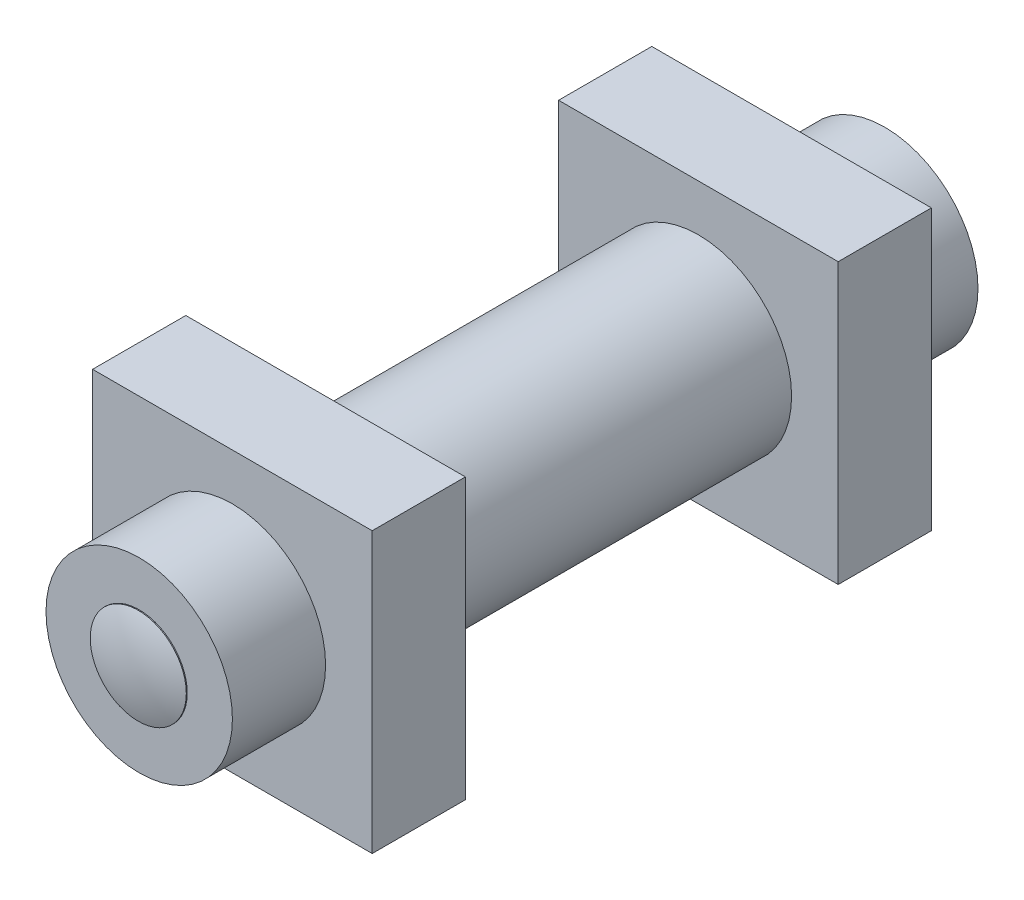
ISO-10303-21;
HEADER;
FILE_DESCRIPTION(('STEP AP214'),'2;1');
FILE_NAME('part.step','',(''),(''),'','','');
FILE_SCHEMA(('AUTOMOTIVE_DESIGN { 1 0 10303 214 1 1 1 1 }'));
ENDSEC;
DATA;
#1=APPLICATION_CONTEXT('core data for automotive mechanical design processes');
#2=APPLICATION_PROTOCOL_DEFINITION('international standard','automotive_design',2000,#1);
#3=PRODUCT_CONTEXT('',#1,'mechanical');
#4=PRODUCT('Part','Part','',(#3));
#5=PRODUCT_RELATED_PRODUCT_CATEGORY('part','',(#4));
#6=PRODUCT_DEFINITION_FORMATION('','',#4);
#7=PRODUCT_DEFINITION_CONTEXT('part definition',#1,'design');
#8=PRODUCT_DEFINITION('design','',#6,#7);
#9=PRODUCT_DEFINITION_SHAPE('','',#8);
#10=(LENGTH_UNIT() NAMED_UNIT(*) SI_UNIT(.MILLI.,.METRE.));
#11=(NAMED_UNIT(*) PLANE_ANGLE_UNIT() SI_UNIT($,.RADIAN.));
#12=(NAMED_UNIT(*) SI_UNIT($,.STERADIAN.) SOLID_ANGLE_UNIT());
#13=UNCERTAINTY_MEASURE_WITH_UNIT(LENGTH_MEASURE(1.E-05),#10,'distance_accuracy_value','');
#14=(GEOMETRIC_REPRESENTATION_CONTEXT(3) GLOBAL_UNCERTAINTY_ASSIGNED_CONTEXT((#13)) GLOBAL_UNIT_ASSIGNED_CONTEXT((#10,
#11,#12)) REPRESENTATION_CONTEXT('',''));
#15=CARTESIAN_POINT('',(0.,0.,0.));
#16=DIRECTION('',(0.,0.,1.));
#17=DIRECTION('',(1.,0.,0.));
#18=AXIS2_PLACEMENT_3D('',#15,#16,#17);
#19=CARTESIAN_POINT('',(0.,0.,101.6));
#20=DIRECTION('',(0.,0.,-1.));
#21=DIRECTION('',(-1.,0.,0.));
#22=AXIS2_PLACEMENT_3D('',#19,#20,#21);
#23=CYLINDRICAL_SURFACE('',#22,25.4);
#24=CARTESIAN_POINT('',(0.,0.,76.2));
#25=DIRECTION('',(0.,0.,1.));
#26=DIRECTION('',(1.,0.,0.));
#27=AXIS2_PLACEMENT_3D('',#24,#25,#26);
#28=CIRCLE('',#27,25.4);
#29=CARTESIAN_POINT('',(25.4,0.,76.2));
#30=VERTEX_POINT('',#29);
#31=EDGE_CURVE('E193',#30,#30,#28,.T.);
#32=ORIENTED_EDGE('',*,*,#31,.T.);
#33=EDGE_LOOP('',(#32));
#34=FACE_BOUND('',#33,.T.);
#35=CARTESIAN_POINT('',(0.,0.,101.6));
#36=DIRECTION('',(0.,0.,1.));
#37=DIRECTION('',(1.,0.,0.));
#38=AXIS2_PLACEMENT_3D('',#35,#36,#37);
#39=CIRCLE('',#38,25.4);
#40=CARTESIAN_POINT('',(25.4,0.,101.6));
#41=VERTEX_POINT('',#40);
#42=EDGE_CURVE('E187',#41,#41,#39,.T.);
#43=ORIENTED_EDGE('',*,*,#42,.F.);
#44=EDGE_LOOP('',(#43));
#45=FACE_BOUND('',#44,.T.);
#46=ADVANCED_FACE('F47',(#34,#45),#23,.T.);
#47=CARTESIAN_POINT('',(0.,0.,101.6));
#48=DIRECTION('',(0.,0.,1.));
#49=DIRECTION('',(1.,0.,0.));
#50=AXIS2_PLACEMENT_3D('',#47,#48,#49);
#51=PLANE('',#50);
#52=CARTESIAN_POINT('',(0.,0.,101.6));
#53=DIRECTION('',(0.,0.,1.));
#54=DIRECTION('',(1.,0.,0.));
#55=AXIS2_PLACEMENT_3D('',#52,#53,#54);
#56=CIRCLE('',#55,13.092802434092);
#57=CARTESIAN_POINT('',(13.092802434092,0.,101.6));
#58=VERTEX_POINT('',#57);
#59=EDGE_CURVE('E57',#58,#58,#56,.T.);
#60=ORIENTED_EDGE('',*,*,#59,.F.);
#61=EDGE_LOOP('',(#60));
#62=FACE_BOUND('',#61,.T.);
#63=ORIENTED_EDGE('',*,*,#42,.T.);
#64=EDGE_LOOP('',(#63));
#65=FACE_BOUND('',#64,.T.);
#66=ADVANCED_FACE('F234',(#62,#65),#51,.T.);
#67=CARTESIAN_POINT('',(-38.1,38.1,76.2));
#68=DIRECTION('',(0.,0.,1.));
#69=DIRECTION('',(1.,0.,0.));
#70=AXIS2_PLACEMENT_3D('',#67,#68,#69);
#71=PLANE('',#70);
#72=ORIENTED_EDGE('',*,*,#31,.F.);
#73=EDGE_LOOP('',(#72));
#74=FACE_BOUND('',#73,.T.);
#75=DIRECTION('',(0.,-1.,0.));
#76=VECTOR('',#75,1.);
#77=CARTESIAN_POINT('',(38.1,38.1,76.2));
#78=LINE('',#77,#76);
#79=CARTESIAN_POINT('',(38.1,38.1,76.2));
#80=VERTEX_POINT('',#79);
#81=CARTESIAN_POINT('',(38.1,-38.1,76.2));
#82=VERTEX_POINT('',#81);
#83=EDGE_CURVE('E162',#80,#82,#78,.T.);
#84=ORIENTED_EDGE('',*,*,#83,.F.);
#85=DIRECTION('',(1.,0.,0.));
#86=VECTOR('',#85,1.);
#87=CARTESIAN_POINT('',(-38.1,38.1,76.2));
#88=LINE('',#87,#86);
#89=CARTESIAN_POINT('',(-38.1,38.1,76.2));
#90=VERTEX_POINT('',#89);
#91=EDGE_CURVE('E66',#90,#80,#88,.T.);
#92=ORIENTED_EDGE('',*,*,#91,.F.);
#93=DIRECTION('',(0.,-1.,0.));
#94=VECTOR('',#93,1.);
#95=CARTESIAN_POINT('',(-38.1,38.1,76.2));
#96=LINE('',#95,#94);
#97=CARTESIAN_POINT('',(-38.1,-38.1,76.2));
#98=VERTEX_POINT('',#97);
#99=EDGE_CURVE('E163',#90,#98,#96,.T.);
#100=ORIENTED_EDGE('',*,*,#99,.T.);
#101=DIRECTION('',(1.,0.,0.));
#102=VECTOR('',#101,1.);
#103=CARTESIAN_POINT('',(-38.1,-38.1,76.2));
#104=LINE('',#103,#102);
#105=EDGE_CURVE('E95',#98,#82,#104,.T.);
#106=ORIENTED_EDGE('',*,*,#105,.T.);
#107=EDGE_LOOP('',(#84,#92,#100,#106));
#108=FACE_BOUND('',#107,.T.);
#109=ADVANCED_FACE('F261',(#74,#108),#71,.T.);
#110=CARTESIAN_POINT('',(-38.1,38.1,76.2));
#111=DIRECTION('',(0.,1.,0.));
#112=DIRECTION('',(0.,0.,1.));
#113=AXIS2_PLACEMENT_3D('',#110,#111,#112);
#114=PLANE('',#113);
#115=DIRECTION('',(0.,0.,1.));
#116=VECTOR('',#115,1.);
#117=CARTESIAN_POINT('',(38.1,38.1,76.2));
#118=LINE('',#117,#116);
#119=CARTESIAN_POINT('',(38.1,38.1,50.8));
#120=VERTEX_POINT('',#119);
#121=EDGE_CURVE('E166',#120,#80,#118,.T.);
#122=ORIENTED_EDGE('',*,*,#121,.F.);
#123=DIRECTION('',(1.,0.,0.));
#124=VECTOR('',#123,1.);
#125=CARTESIAN_POINT('',(-38.1,38.1,50.8));
#126=LINE('',#125,#124);
#127=CARTESIAN_POINT('',(-38.1,38.1,50.8));
#128=VERTEX_POINT('',#127);
#129=EDGE_CURVE('E84',#128,#120,#126,.T.);
#130=ORIENTED_EDGE('',*,*,#129,.F.);
#131=DIRECTION('',(0.,0.,1.));
#132=VECTOR('',#131,1.);
#133=CARTESIAN_POINT('',(-38.1,38.1,76.2));
#134=LINE('',#133,#132);
#135=EDGE_CURVE('E170',#128,#90,#134,.T.);
#136=ORIENTED_EDGE('',*,*,#135,.T.);
#137=ORIENTED_EDGE('',*,*,#91,.T.);
#138=EDGE_LOOP('',(#122,#130,#136,#137));
#139=FACE_BOUND('',#138,.T.);
#140=ADVANCED_FACE('F256',(#139),#114,.T.);
#141=CARTESIAN_POINT('',(-38.1,38.1,50.8));
#142=DIRECTION('',(0.,0.,-1.));
#143=DIRECTION('',(0.,1.,0.));
#144=AXIS2_PLACEMENT_3D('',#141,#142,#143);
#145=PLANE('',#144);
#146=CARTESIAN_POINT('',(0.,0.,50.8));
#147=DIRECTION('',(0.,0.,-1.));
#148=DIRECTION('',(0.,1.,0.));
#149=AXIS2_PLACEMENT_3D('',#146,#147,#148);
#150=CIRCLE('',#149,25.4);
#151=CARTESIAN_POINT('',(0.,25.4,50.8));
#152=VERTEX_POINT('',#151);
#153=EDGE_CURVE('E182',#152,#152,#150,.T.);
#154=ORIENTED_EDGE('',*,*,#153,.F.);
#155=EDGE_LOOP('',(#154));
#156=FACE_BOUND('',#155,.T.);
#157=DIRECTION('',(0.,1.,0.));
#158=VECTOR('',#157,1.);
#159=CARTESIAN_POINT('',(38.1,38.1,50.8));
#160=LINE('',#159,#158);
#161=CARTESIAN_POINT('',(38.1,-38.1,50.8));
#162=VERTEX_POINT('',#161);
#163=EDGE_CURVE('E177',#162,#120,#160,.T.);
#164=ORIENTED_EDGE('',*,*,#163,.F.);
#165=DIRECTION('',(1.,0.,0.));
#166=VECTOR('',#165,1.);
#167=CARTESIAN_POINT('',(-38.1,-38.1,50.8));
#168=LINE('',#167,#166);
#169=CARTESIAN_POINT('',(-38.1,-38.1,50.8));
#170=VERTEX_POINT('',#169);
#171=EDGE_CURVE('E184',#170,#162,#168,.T.);
#172=ORIENTED_EDGE('',*,*,#171,.F.);
#173=DIRECTION('',(0.,1.,0.));
#174=VECTOR('',#173,1.);
#175=CARTESIAN_POINT('',(-38.1,38.1,50.8));
#176=LINE('',#175,#174);
#177=EDGE_CURVE('E168',#170,#128,#176,.T.);
#178=ORIENTED_EDGE('',*,*,#177,.T.);
#179=ORIENTED_EDGE('',*,*,#129,.T.);
#180=EDGE_LOOP('',(#164,#172,#178,#179));
#181=FACE_BOUND('',#180,.T.);
#182=ADVANCED_FACE('F253',(#156,#181),#145,.T.);
#183=CARTESIAN_POINT('',(-38.1,-38.1,50.8));
#184=DIRECTION('',(0.,-1.,0.));
#185=DIRECTION('',(0.,0.,-1.));
#186=AXIS2_PLACEMENT_3D('',#183,#184,#185);
#187=PLANE('',#186);
#188=DIRECTION('',(0.,0.,-1.));
#189=VECTOR('',#188,1.);
#190=CARTESIAN_POINT('',(38.1,-38.1,50.8));
#191=LINE('',#190,#189);
#192=EDGE_CURVE('E174',#82,#162,#191,.T.);
#193=ORIENTED_EDGE('',*,*,#192,.F.);
#194=ORIENTED_EDGE('',*,*,#105,.F.);
#195=DIRECTION('',(0.,0.,-1.));
#196=VECTOR('',#195,1.);
#197=CARTESIAN_POINT('',(-38.1,-38.1,50.8));
#198=LINE('',#197,#196);
#199=EDGE_CURVE('E165',#98,#170,#198,.T.);
#200=ORIENTED_EDGE('',*,*,#199,.T.);
#201=ORIENTED_EDGE('',*,*,#171,.T.);
#202=EDGE_LOOP('',(#193,#194,#200,#201));
#203=FACE_BOUND('',#202,.T.);
#204=ADVANCED_FACE('F255',(#203),#187,.T.);
#205=CARTESIAN_POINT('',(-38.1,0.,0.));
#206=DIRECTION('',(-1.,0.,0.));
#207=DIRECTION('',(0.,0.,1.));
#208=AXIS2_PLACEMENT_3D('',#205,#206,#207);
#209=PLANE('',#208);
#210=ORIENTED_EDGE('',*,*,#99,.F.);
#211=ORIENTED_EDGE('',*,*,#135,.F.);
#212=ORIENTED_EDGE('',*,*,#177,.F.);
#213=ORIENTED_EDGE('',*,*,#199,.F.);
#214=EDGE_LOOP('',(#210,#211,#212,#213));
#215=FACE_BOUND('',#214,.T.);
#216=ADVANCED_FACE('F246',(#215),#209,.T.);
#217=CARTESIAN_POINT('',(38.1,0.,0.));
#218=DIRECTION('',(-1.,0.,0.));
#219=DIRECTION('',(0.,0.,1.));
#220=AXIS2_PLACEMENT_3D('',#217,#218,#219);
#221=PLANE('',#220);
#222=ORIENTED_EDGE('',*,*,#83,.T.);
#223=ORIENTED_EDGE('',*,*,#192,.T.);
#224=ORIENTED_EDGE('',*,*,#163,.T.);
#225=ORIENTED_EDGE('',*,*,#121,.T.);
#226=EDGE_LOOP('',(#222,#223,#224,#225));
#227=FACE_BOUND('',#226,.T.);
#228=ADVANCED_FACE('F237',(#227),#221,.F.);
#229=CARTESIAN_POINT('',(0.,0.,-50.8));
#230=DIRECTION('',(0.,0.,-1.));
#231=DIRECTION('',(0.,1.,0.));
#232=AXIS2_PLACEMENT_3D('',#229,#230,#231);
#233=CIRCLE('',#232,25.4);
#234=CARTESIAN_POINT('',(0.,25.4,-50.8));
#235=VERTEX_POINT('',#234);
#236=EDGE_CURVE('E155',#235,#235,#233,.T.);
#237=ORIENTED_EDGE('',*,*,#236,.F.);
#238=EDGE_LOOP('',(#237));
#239=FACE_BOUND('',#238,.T.);
#240=ORIENTED_EDGE('',*,*,#153,.T.);
#241=EDGE_LOOP('',(#240));
#242=FACE_BOUND('',#241,.T.);
#243=ADVANCED_FACE('F226',(#239,#242),#23,.T.);
#244=CARTESIAN_POINT('',(-38.1,38.1,-76.2));
#245=DIRECTION('',(0.,0.,-1.));
#246=DIRECTION('',(1.,0.,0.));
#247=AXIS2_PLACEMENT_3D('',#244,#245,#246);
#248=PLANE('',#247);
#249=CARTESIAN_POINT('',(0.,0.,-76.2));
#250=DIRECTION('',(0.,0.,1.));
#251=DIRECTION('',(1.,0.,0.));
#252=AXIS2_PLACEMENT_3D('',#249,#250,#251);
#253=CIRCLE('',#252,25.4);
#254=CARTESIAN_POINT('',(25.4,0.,-76.2));
#255=VERTEX_POINT('',#254);
#256=EDGE_CURVE('E158',#255,#255,#253,.T.);
#257=ORIENTED_EDGE('',*,*,#256,.T.);
#258=EDGE_LOOP('',(#257));
#259=FACE_BOUND('',#258,.T.);
#260=DIRECTION('',(0.,-1.,0.));
#261=VECTOR('',#260,1.);
#262=CARTESIAN_POINT('',(38.1,38.1,-76.2));
#263=LINE('',#262,#261);
#264=CARTESIAN_POINT('',(38.1,38.1,-76.2));
#265=VERTEX_POINT('',#264);
#266=CARTESIAN_POINT('',(38.1,-38.1,-76.2));
#267=VERTEX_POINT('',#266);
#268=EDGE_CURVE('E148',#265,#267,#263,.T.);
#269=ORIENTED_EDGE('',*,*,#268,.T.);
#270=DIRECTION('',(1.,0.,0.));
#271=VECTOR('',#270,1.);
#272=CARTESIAN_POINT('',(-38.1,-38.1,-76.2));
#273=LINE('',#272,#271);
#274=CARTESIAN_POINT('',(-38.1,-38.1,-76.2));
#275=VERTEX_POINT('',#274);
#276=EDGE_CURVE('E128',#275,#267,#273,.T.);
#277=ORIENTED_EDGE('',*,*,#276,.F.);
#278=DIRECTION('',(0.,-1.,0.));
#279=VECTOR('',#278,1.);
#280=CARTESIAN_POINT('',(-38.1,38.1,-76.2));
#281=LINE('',#280,#279);
#282=CARTESIAN_POINT('',(-38.1,38.1,-76.2));
#283=VERTEX_POINT('',#282);
#284=EDGE_CURVE('E135',#283,#275,#281,.T.);
#285=ORIENTED_EDGE('',*,*,#284,.F.);
#286=DIRECTION('',(1.,0.,0.));
#287=VECTOR('',#286,1.);
#288=CARTESIAN_POINT('',(-38.1,38.1,-76.2));
#289=LINE('',#288,#287);
#290=EDGE_CURVE('E159',#283,#265,#289,.T.);
#291=ORIENTED_EDGE('',*,*,#290,.T.);
#292=EDGE_LOOP('',(#269,#277,#285,#291));
#293=FACE_BOUND('',#292,.T.);
#294=ADVANCED_FACE('F146',(#259,#293),#248,.T.);
#295=CARTESIAN_POINT('',(-38.1,38.1,-76.2));
#296=DIRECTION('',(0.,1.,0.));
#297=DIRECTION('',(0.,0.,-1.));
#298=AXIS2_PLACEMENT_3D('',#295,#296,#297);
#299=PLANE('',#298);
#300=DIRECTION('',(0.,0.,-1.));
#301=VECTOR('',#300,1.);
#302=CARTESIAN_POINT('',(38.1,38.1,-76.2));
#303=LINE('',#302,#301);
#304=CARTESIAN_POINT('',(38.1,38.1,-50.8));
#305=VERTEX_POINT('',#304);
#306=EDGE_CURVE('E144',#305,#265,#303,.T.);
#307=ORIENTED_EDGE('',*,*,#306,.T.);
#308=ORIENTED_EDGE('',*,*,#290,.F.);
#309=DIRECTION('',(0.,0.,-1.));
#310=VECTOR('',#309,1.);
#311=CARTESIAN_POINT('',(-38.1,38.1,-76.2));
#312=LINE('',#311,#310);
#313=CARTESIAN_POINT('',(-38.1,38.1,-50.8));
#314=VERTEX_POINT('',#313);
#315=EDGE_CURVE('E140',#314,#283,#312,.T.);
#316=ORIENTED_EDGE('',*,*,#315,.F.);
#317=DIRECTION('',(1.,0.,0.));
#318=VECTOR('',#317,1.);
#319=CARTESIAN_POINT('',(-38.1,38.1,-50.8));
#320=LINE('',#319,#318);
#321=EDGE_CURVE('E150',#314,#305,#320,.T.);
#322=ORIENTED_EDGE('',*,*,#321,.T.);
#323=EDGE_LOOP('',(#307,#308,#316,#322));
#324=FACE_BOUND('',#323,.T.);
#325=ADVANCED_FACE('F243',(#324),#299,.T.);
#326=CARTESIAN_POINT('',(-38.1,38.1,-50.8));
#327=DIRECTION('',(0.,0.,1.));
#328=DIRECTION('',(0.,1.,0.));
#329=AXIS2_PLACEMENT_3D('',#326,#327,#328);
#330=PLANE('',#329);
#331=ORIENTED_EDGE('',*,*,#236,.T.);
#332=EDGE_LOOP('',(#331));
#333=FACE_BOUND('',#332,.T.);
#334=DIRECTION('',(0.,1.,0.));
#335=VECTOR('',#334,1.);
#336=CARTESIAN_POINT('',(38.1,38.1,-50.8));
#337=LINE('',#336,#335);
#338=CARTESIAN_POINT('',(38.1,-38.1,-50.8));
#339=VERTEX_POINT('',#338);
#340=EDGE_CURVE('E287',#339,#305,#337,.T.);
#341=ORIENTED_EDGE('',*,*,#340,.T.);
#342=ORIENTED_EDGE('',*,*,#321,.F.);
#343=DIRECTION('',(0.,1.,0.));
#344=VECTOR('',#343,1.);
#345=CARTESIAN_POINT('',(-38.1,38.1,-50.8));
#346=LINE('',#345,#344);
#347=CARTESIAN_POINT('',(-38.1,-38.1,-50.8));
#348=VERTEX_POINT('',#347);
#349=EDGE_CURVE('E134',#348,#314,#346,.T.);
#350=ORIENTED_EDGE('',*,*,#349,.F.);
#351=DIRECTION('',(1.,0.,0.));
#352=VECTOR('',#351,1.);
#353=CARTESIAN_POINT('',(-38.1,-38.1,-50.8));
#354=LINE('',#353,#352);
#355=EDGE_CURVE('E131',#348,#339,#354,.T.);
#356=ORIENTED_EDGE('',*,*,#355,.T.);
#357=EDGE_LOOP('',(#341,#342,#350,#356));
#358=FACE_BOUND('',#357,.T.);
#359=ADVANCED_FACE('F297',(#333,#358),#330,.T.);
#360=CARTESIAN_POINT('',(-38.1,-38.1,-50.8));
#361=DIRECTION('',(0.,-1.,0.));
#362=DIRECTION('',(0.,0.,1.));
#363=AXIS2_PLACEMENT_3D('',#360,#361,#362);
#364=PLANE('',#363);
#365=DIRECTION('',(0.,0.,1.));
#366=VECTOR('',#365,1.);
#367=CARTESIAN_POINT('',(38.1,-38.1,-50.8));
#368=LINE('',#367,#366);
#369=EDGE_CURVE('E201',#267,#339,#368,.T.);
#370=ORIENTED_EDGE('',*,*,#369,.T.);
#371=ORIENTED_EDGE('',*,*,#355,.F.);
#372=DIRECTION('',(0.,0.,1.));
#373=VECTOR('',#372,1.);
#374=CARTESIAN_POINT('',(-38.1,-38.1,-50.8));
#375=LINE('',#374,#373);
#376=EDGE_CURVE('E124',#275,#348,#375,.T.);
#377=ORIENTED_EDGE('',*,*,#376,.F.);
#378=ORIENTED_EDGE('',*,*,#276,.T.);
#379=EDGE_LOOP('',(#370,#371,#377,#378));
#380=FACE_BOUND('',#379,.T.);
#381=ADVANCED_FACE('F126',(#380),#364,.T.);
#382=CARTESIAN_POINT('',(-38.1,0.,0.));
#383=DIRECTION('',(-1.,0.,0.));
#384=DIRECTION('',(0.,0.,-1.));
#385=AXIS2_PLACEMENT_3D('',#382,#383,#384);
#386=PLANE('',#385);
#387=ORIENTED_EDGE('',*,*,#284,.T.);
#388=ORIENTED_EDGE('',*,*,#376,.T.);
#389=ORIENTED_EDGE('',*,*,#349,.T.);
#390=ORIENTED_EDGE('',*,*,#315,.T.);
#391=EDGE_LOOP('',(#387,#388,#389,#390));
#392=FACE_BOUND('',#391,.T.);
#393=ADVANCED_FACE('F138',(#392),#386,.T.);
#394=CARTESIAN_POINT('',(38.1,0.,0.));
#395=DIRECTION('',(-1.,0.,0.));
#396=DIRECTION('',(0.,0.,-1.));
#397=AXIS2_PLACEMENT_3D('',#394,#395,#396);
#398=PLANE('',#397);
#399=ORIENTED_EDGE('',*,*,#268,.F.);
#400=ORIENTED_EDGE('',*,*,#306,.F.);
#401=ORIENTED_EDGE('',*,*,#340,.F.);
#402=ORIENTED_EDGE('',*,*,#369,.F.);
#403=EDGE_LOOP('',(#399,#400,#401,#402));
#404=FACE_BOUND('',#403,.T.);
#405=ADVANCED_FACE('F218',(#404),#398,.F.);
#406=CARTESIAN_POINT('',(0.,0.,-101.6));
#407=DIRECTION('',(0.,0.,1.));
#408=DIRECTION('',(1.,0.,0.));
#409=AXIS2_PLACEMENT_3D('',#406,#407,#408);
#410=PLANE('',#409);
#411=CARTESIAN_POINT('',(0.,0.,-101.6));
#412=DIRECTION('',(0.,0.,-1.));
#413=DIRECTION('',(-1.,0.,0.));
#414=AXIS2_PLACEMENT_3D('',#411,#412,#413);
#415=CIRCLE('',#414,12.5417740916613);
#416=CARTESIAN_POINT('',(-12.5417740916613,0.,-101.6));
#417=VERTEX_POINT('',#416);
#418=EDGE_CURVE('E12',#417,#417,#415,.T.);
#419=ORIENTED_EDGE('',*,*,#418,.F.);
#420=EDGE_LOOP('',(#419));
#421=FACE_BOUND('',#420,.T.);
#422=CARTESIAN_POINT('',(0.,0.,-101.6));
#423=DIRECTION('',(0.,0.,1.));
#424=DIRECTION('',(1.,0.,0.));
#425=AXIS2_PLACEMENT_3D('',#422,#423,#424);
#426=CIRCLE('',#425,25.4);
#427=CARTESIAN_POINT('',(25.4,0.,-101.6));
#428=VERTEX_POINT('',#427);
#429=EDGE_CURVE('E190',#428,#428,#426,.T.);
#430=ORIENTED_EDGE('',*,*,#429,.F.);
#431=EDGE_LOOP('',(#430));
#432=FACE_BOUND('',#431,.T.);
#433=ADVANCED_FACE('F214',(#421,#432),#410,.F.);
#434=ORIENTED_EDGE('',*,*,#256,.F.);
#435=EDGE_LOOP('',(#434));
#436=FACE_BOUND('',#435,.T.);
#437=ORIENTED_EDGE('',*,*,#429,.T.);
#438=EDGE_LOOP('',(#437));
#439=FACE_BOUND('',#438,.T.);
#440=ADVANCED_FACE('F217',(#436,#439),#23,.T.);
#441=CARTESIAN_POINT('',(0.,0.,101.854));
#442=DIRECTION('',(0.,0.,-1.));
#443=DIRECTION('',(-1.,0.,0.));
#444=AXIS2_PLACEMENT_3D('',#441,#442,#443);
#445=CYLINDRICAL_SURFACE('',#444,13.092802434092);
#446=CARTESIAN_POINT('',(0.,0.,101.854));
#447=DIRECTION('',(0.,0.,1.));
#448=DIRECTION('',(1.,0.,0.));
#449=AXIS2_PLACEMENT_3D('',#446,#447,#448);
#450=CIRCLE('',#449,13.092802434092);
#451=CARTESIAN_POINT('',(13.092802434092,0.,101.854));
#452=VERTEX_POINT('',#451);
#453=EDGE_CURVE('E197',#452,#452,#450,.T.);
#454=ORIENTED_EDGE('',*,*,#453,.F.);
#455=EDGE_LOOP('',(#454));
#456=FACE_BOUND('',#455,.T.);
#457=ORIENTED_EDGE('',*,*,#59,.T.);
#458=EDGE_LOOP('',(#457));
#459=FACE_BOUND('',#458,.T.);
#460=ADVANCED_FACE('F223',(#456,#459),#445,.T.);
#461=CARTESIAN_POINT('',(0.,0.,67.0310849625701));
#462=DIRECTION('',(0.,0.,1.));
#463=DIRECTION('',(1.,0.,0.));
#464=AXIS2_PLACEMENT_3D('',#461,#462,#463);
#465=SPHERICAL_SURFACE('',#464,37.2029150374299);
#466=ORIENTED_EDGE('',*,*,#453,.T.);
#467=EDGE_LOOP('',(#466));
#468=FACE_BOUND('',#467,.T.);
#469=ADVANCED_FACE('F210',(#468),#465,.T.);
#470=CARTESIAN_POINT('',(0.,0.,-101.854));
#471=DIRECTION('',(0.,0.,1.));
#472=DIRECTION('',(1.,0.,0.));
#473=AXIS2_PLACEMENT_3D('',#470,#471,#472);
#474=CYLINDRICAL_SURFACE('',#473,12.5417740916613);
#475=CARTESIAN_POINT('',(0.,0.,-101.854));
#476=DIRECTION('',(0.,0.,-1.));
#477=DIRECTION('',(-1.,0.,0.));
#478=AXIS2_PLACEMENT_3D('',#475,#476,#477);
#479=CIRCLE('',#478,12.5417740916613);
#480=CARTESIAN_POINT('',(-12.5417740916613,0.,-101.854));
#481=VERTEX_POINT('',#480);
#482=EDGE_CURVE('E51',#481,#481,#479,.T.);
#483=ORIENTED_EDGE('',*,*,#482,.F.);
#484=EDGE_LOOP('',(#483));
#485=FACE_BOUND('',#484,.T.);
#486=ORIENTED_EDGE('',*,*,#418,.T.);
#487=EDGE_LOOP('',(#486));
#488=FACE_BOUND('',#487,.T.);
#489=ADVANCED_FACE('F207',(#485,#488),#474,.T.);
#490=CARTESIAN_POINT('',(0.,0.,-69.9986013936414));
#491=DIRECTION('',(0.,0.,1.));
#492=DIRECTION('',(1.,0.,0.));
#493=AXIS2_PLACEMENT_3D('',#490,#491,#492);
#494=SPHERICAL_SURFACE('',#493,34.2353986063586);
#495=ORIENTED_EDGE('',*,*,#482,.T.);
#496=EDGE_LOOP('',(#495));
#497=FACE_BOUND('',#496,.T.);
#498=ADVANCED_FACE('F49',(#497),#494,.T.);
#499=CLOSED_SHELL('',(#46,#66,#109,#140,#182,#204,#216,#228,#243,#294,#325,#359,#381,#393,#405,
#433,#440,#460,#469,#489,#498));
#500=MANIFOLD_SOLID_BREP('B2',#499);
#501=ADVANCED_BREP_SHAPE_REPRESENTATION('',(#18,#500),#14);
#502=SHAPE_DEFINITION_REPRESENTATION(#9,#501);
ENDSEC;
END-ISO-10303-21;
